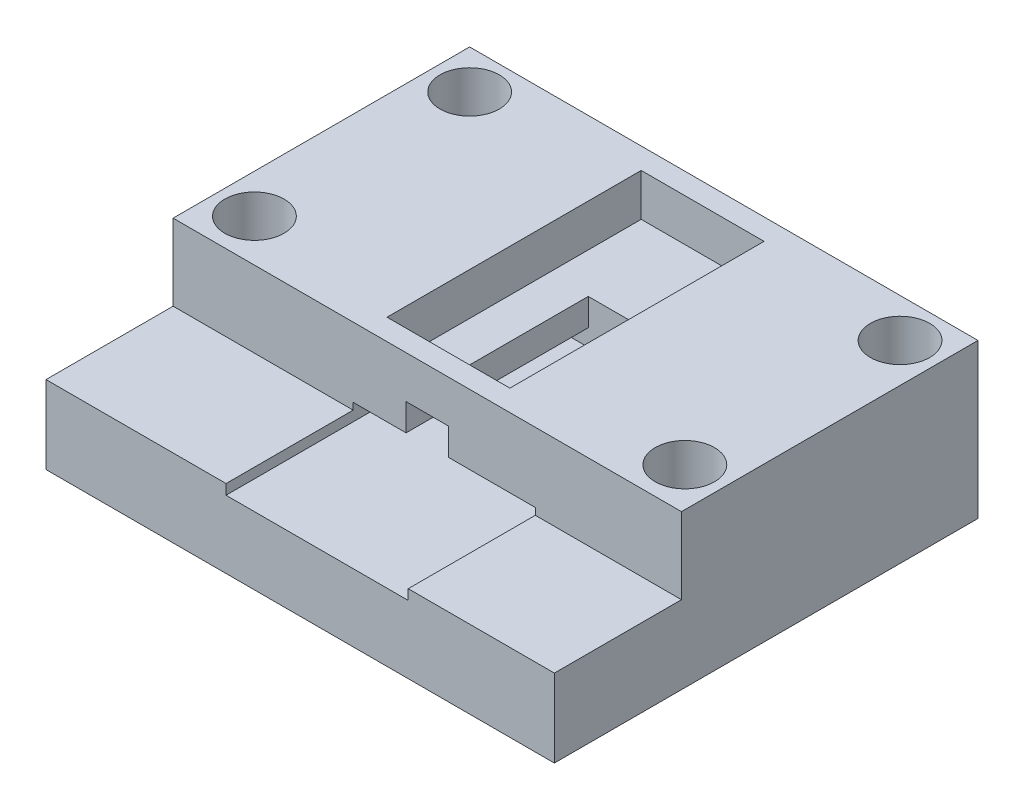
ISO-10303-21;
HEADER;
FILE_DESCRIPTION(('STEP AP214'),'2;1');
FILE_NAME('part.step','',(''),(''),'','','');
FILE_SCHEMA(('AUTOMOTIVE_DESIGN { 1 0 10303 214 1 1 1 1 }'));
ENDSEC;
DATA;
#1=APPLICATION_CONTEXT('core data for automotive mechanical design processes');
#2=APPLICATION_PROTOCOL_DEFINITION('international standard','automotive_design',2000,#1);
#3=PRODUCT_CONTEXT('',#1,'mechanical');
#4=PRODUCT('Part','Part','',(#3));
#5=PRODUCT_RELATED_PRODUCT_CATEGORY('part','',(#4));
#6=PRODUCT_DEFINITION_FORMATION('','',#4);
#7=PRODUCT_DEFINITION_CONTEXT('part definition',#1,'design');
#8=PRODUCT_DEFINITION('design','',#6,#7);
#9=PRODUCT_DEFINITION_SHAPE('','',#8);
#10=(LENGTH_UNIT() NAMED_UNIT(*) SI_UNIT(.MILLI.,.METRE.));
#11=(NAMED_UNIT(*) PLANE_ANGLE_UNIT() SI_UNIT($,.RADIAN.));
#12=(NAMED_UNIT(*) SI_UNIT($,.STERADIAN.) SOLID_ANGLE_UNIT());
#13=UNCERTAINTY_MEASURE_WITH_UNIT(LENGTH_MEASURE(1.E-05),#10,'distance_accuracy_value','');
#14=(GEOMETRIC_REPRESENTATION_CONTEXT(3) GLOBAL_UNCERTAINTY_ASSIGNED_CONTEXT((#13)) GLOBAL_UNIT_ASSIGNED_CONTEXT((#10,
#11,#12)) REPRESENTATION_CONTEXT('',''));
#15=CARTESIAN_POINT('',(0.,0.,0.));
#16=DIRECTION('',(0.,0.,1.));
#17=DIRECTION('',(1.,0.,0.));
#18=AXIS2_PLACEMENT_3D('',#15,#16,#17);
#19=CARTESIAN_POINT('',(0.,13.2,0.));
#20=DIRECTION('',(0.,1.,0.));
#21=DIRECTION('',(0.,0.,1.));
#22=AXIS2_PLACEMENT_3D('',#19,#20,#21);
#23=PLANE('',#22);
#24=DIRECTION('',(0.,0.,1.));
#25=VECTOR('',#24,1.);
#26=CARTESIAN_POINT('',(22.75,13.2,-47.5));
#27=LINE('',#26,#25);
#28=CARTESIAN_POINT('',(22.75,13.2,-47.5));
#29=VERTEX_POINT('',#28);
#30=CARTESIAN_POINT('',(22.75,13.2,-17.5));
#31=VERTEX_POINT('',#30);
#32=EDGE_CURVE('E285',#29,#31,#27,.T.);
#33=ORIENTED_EDGE('',*,*,#32,.T.);
#34=DIRECTION('',(1.,0.,0.));
#35=VECTOR('',#34,1.);
#36=CARTESIAN_POINT('',(22.75,13.2,-17.5));
#37=LINE('',#36,#35);
#38=CARTESIAN_POINT('',(27.5,13.2,-17.5));
#39=VERTEX_POINT('',#38);
#40=EDGE_CURVE('E304',#31,#39,#37,.T.);
#41=ORIENTED_EDGE('',*,*,#40,.T.);
#42=DIRECTION('',(0.,0.,1.));
#43=VECTOR('',#42,1.);
#44=CARTESIAN_POINT('',(27.5,13.2,0.));
#45=LINE('',#44,#43);
#46=CARTESIAN_POINT('',(27.5,13.2,-36.5));
#47=VERTEX_POINT('',#46);
#48=EDGE_CURVE('E339',#47,#39,#45,.T.);
#49=ORIENTED_EDGE('',*,*,#48,.F.);
#50=DIRECTION('',(1.,0.,0.));
#51=VECTOR('',#50,1.);
#52=CARTESIAN_POINT('',(0.,13.2,-36.5));
#53=LINE('',#52,#51);
#54=CARTESIAN_POINT('',(32.5,13.2,-36.5));
#55=VERTEX_POINT('',#54);
#56=EDGE_CURVE('E343',#47,#55,#53,.T.);
#57=ORIENTED_EDGE('',*,*,#56,.T.);
#58=DIRECTION('',(0.,0.,1.));
#59=VECTOR('',#58,1.);
#60=CARTESIAN_POINT('',(32.5,13.2,0.));
#61=LINE('',#60,#59);
#62=CARTESIAN_POINT('',(32.5,13.2,-17.5));
#63=VERTEX_POINT('',#62);
#64=EDGE_CURVE('E348',#55,#63,#61,.T.);
#65=ORIENTED_EDGE('',*,*,#64,.T.);
#66=CARTESIAN_POINT('',(37.25,13.2,-17.5));
#67=VERTEX_POINT('',#66);
#68=EDGE_CURVE('E309',#63,#67,#37,.T.);
#69=ORIENTED_EDGE('',*,*,#68,.T.);
#70=DIRECTION('',(0.,0.,-1.));
#71=VECTOR('',#70,1.);
#72=CARTESIAN_POINT('',(37.25,13.2,-47.5));
#73=LINE('',#72,#71);
#74=CARTESIAN_POINT('',(37.25,13.2,-47.5));
#75=VERTEX_POINT('',#74);
#76=EDGE_CURVE('E308',#67,#75,#73,.T.);
#77=ORIENTED_EDGE('',*,*,#76,.T.);
#78=DIRECTION('',(-1.,0.,0.));
#79=VECTOR('',#78,1.);
#80=CARTESIAN_POINT('',(22.75,13.2,-47.5));
#81=LINE('',#80,#79);
#82=EDGE_CURVE('E290',#75,#29,#81,.T.);
#83=ORIENTED_EDGE('',*,*,#82,.T.);
#84=EDGE_LOOP('',(#33,#41,#49,#57,#65,#69,#77,#83));
#85=FACE_BOUND('',#84,.T.);
#86=ADVANCED_FACE('F48',(#85),#23,.T.);
#87=CARTESIAN_POINT('',(0.,10.,0.));
#88=DIRECTION('',(1.,0.,0.));
#89=DIRECTION('',(0.,0.,-1.));
#90=AXIS2_PLACEMENT_3D('',#87,#88,#89);
#91=PLANE('',#90);
#92=DIRECTION('',(0.,0.,1.));
#93=VECTOR('',#92,1.);
#94=CARTESIAN_POINT('',(0.,9.2,-15.));
#95=LINE('',#94,#93);
#96=CARTESIAN_POINT('',(0.,9.2,-15.));
#97=VERTEX_POINT('',#96);
#98=CARTESIAN_POINT('',(0.,9.2,0.));
#99=VERTEX_POINT('',#98);
#100=EDGE_CURVE('E201',#97,#99,#95,.T.);
#101=ORIENTED_EDGE('',*,*,#100,.F.);
#102=DIRECTION('',(0.,1.,0.));
#103=VECTOR('',#102,1.);
#104=CARTESIAN_POINT('',(0.,9.2,-15.));
#105=LINE('',#104,#103);
#106=CARTESIAN_POINT('',(0.,18.2,-15.));
#107=VERTEX_POINT('',#106);
#108=EDGE_CURVE('E219',#97,#107,#105,.T.);
#109=ORIENTED_EDGE('',*,*,#108,.T.);
#110=DIRECTION('',(0.,0.,1.));
#111=VECTOR('',#110,1.);
#112=CARTESIAN_POINT('',(0.,18.2,-50.));
#113=LINE('',#112,#111);
#114=CARTESIAN_POINT('',(0.,18.2,-50.));
#115=VERTEX_POINT('',#114);
#116=EDGE_CURVE('E328',#115,#107,#113,.T.);
#117=ORIENTED_EDGE('',*,*,#116,.F.);
#118=DIRECTION('',(0.,-1.,0.));
#119=VECTOR('',#118,1.);
#120=CARTESIAN_POINT('',(0.,10.,-50.));
#121=LINE('',#120,#119);
#122=CARTESIAN_POINT('',(0.,0.,-50.));
#123=VERTEX_POINT('',#122);
#124=EDGE_CURVE('E424',#115,#123,#121,.T.);
#125=ORIENTED_EDGE('',*,*,#124,.T.);
#126=DIRECTION('',(0.,0.,1.));
#127=VECTOR('',#126,1.);
#128=CARTESIAN_POINT('',(0.,0.,0.));
#129=LINE('',#128,#127);
#130=CARTESIAN_POINT('',(0.,0.,0.));
#131=VERTEX_POINT('',#130);
#132=EDGE_CURVE('E399',#123,#131,#129,.T.);
#133=ORIENTED_EDGE('',*,*,#132,.T.);
#134=DIRECTION('',(0.,-1.,0.));
#135=VECTOR('',#134,1.);
#136=CARTESIAN_POINT('',(0.,10.,0.));
#137=LINE('',#136,#135);
#138=EDGE_CURVE('E435',#99,#131,#137,.T.);
#139=ORIENTED_EDGE('',*,*,#138,.F.);
#140=EDGE_LOOP('',(#101,#109,#117,#125,#133,#139));
#141=FACE_BOUND('',#140,.T.);
#142=ADVANCED_FACE('F50',(#141),#91,.F.);
#143=CARTESIAN_POINT('',(0.,10.,0.));
#144=DIRECTION('',(0.,0.,-1.));
#145=DIRECTION('',(-1.,0.,0.));
#146=AXIS2_PLACEMENT_3D('',#143,#144,#145);
#147=PLANE('',#146);
#148=DIRECTION('',(0.,-1.,0.));
#149=VECTOR('',#148,1.);
#150=CARTESIAN_POINT('',(60.,10.,0.));
#151=LINE('',#150,#149);
#152=CARTESIAN_POINT('',(60.,9.2,0.));
#153=VERTEX_POINT('',#152);
#154=CARTESIAN_POINT('',(60.,0.,0.));
#155=VERTEX_POINT('',#154);
#156=EDGE_CURVE('E432',#153,#155,#151,.T.);
#157=ORIENTED_EDGE('',*,*,#156,.F.);
#158=DIRECTION('',(1.,0.,0.));
#159=VECTOR('',#158,1.);
#160=CARTESIAN_POINT('',(60.,9.2,0.));
#161=LINE('',#160,#159);
#162=CARTESIAN_POINT('',(42.75,9.2,0.));
#163=VERTEX_POINT('',#162);
#164=EDGE_CURVE('E208',#163,#153,#161,.T.);
#165=ORIENTED_EDGE('',*,*,#164,.F.);
#166=DIRECTION('',(0.,1.,0.));
#167=VECTOR('',#166,1.);
#168=CARTESIAN_POINT('',(42.75,8.,0.));
#169=LINE('',#168,#167);
#170=CARTESIAN_POINT('',(42.75,8.,0.));
#171=VERTEX_POINT('',#170);
#172=EDGE_CURVE('E404',#171,#163,#169,.T.);
#173=ORIENTED_EDGE('',*,*,#172,.F.);
#174=DIRECTION('',(1.,0.,0.));
#175=VECTOR('',#174,1.);
#176=CARTESIAN_POINT('',(21.25,8.,0.));
#177=LINE('',#176,#175);
#178=CARTESIAN_POINT('',(21.25,8.,0.));
#179=VERTEX_POINT('',#178);
#180=EDGE_CURVE('E371',#179,#171,#177,.T.);
#181=ORIENTED_EDGE('',*,*,#180,.F.);
#182=DIRECTION('',(0.,1.,0.));
#183=VECTOR('',#182,1.);
#184=CARTESIAN_POINT('',(21.25,8.,0.));
#185=LINE('',#184,#183);
#186=CARTESIAN_POINT('',(21.25,9.2,0.));
#187=VERTEX_POINT('',#186);
#188=EDGE_CURVE('E384',#179,#187,#185,.T.);
#189=ORIENTED_EDGE('',*,*,#188,.T.);
#190=EDGE_CURVE('E220',#99,#187,#161,.T.);
#191=ORIENTED_EDGE('',*,*,#190,.F.);
#192=ORIENTED_EDGE('',*,*,#138,.T.);
#193=DIRECTION('',(1.,0.,0.));
#194=VECTOR('',#193,1.);
#195=CARTESIAN_POINT('',(0.,0.,0.));
#196=LINE('',#195,#194);
#197=EDGE_CURVE('E414',#131,#155,#196,.T.);
#198=ORIENTED_EDGE('',*,*,#197,.T.);
#199=EDGE_LOOP('',(#157,#165,#173,#181,#189,#191,#192,#198));
#200=FACE_BOUND('',#199,.T.);
#201=ADVANCED_FACE('F468',(#200),#147,.F.);
#202=CARTESIAN_POINT('',(60.,10.,0.));
#203=DIRECTION('',(-1.,0.,0.));
#204=DIRECTION('',(0.,0.,1.));
#205=AXIS2_PLACEMENT_3D('',#202,#203,#204);
#206=PLANE('',#205);
#207=DIRECTION('',(0.,0.,-1.));
#208=VECTOR('',#207,1.);
#209=CARTESIAN_POINT('',(60.,18.2,-50.));
#210=LINE('',#209,#208);
#211=CARTESIAN_POINT('',(60.,18.2,-15.));
#212=VERTEX_POINT('',#211);
#213=CARTESIAN_POINT('',(60.,18.2,-50.));
#214=VERTEX_POINT('',#213);
#215=EDGE_CURVE('E217',#212,#214,#210,.T.);
#216=ORIENTED_EDGE('',*,*,#215,.F.);
#217=DIRECTION('',(0.,1.,0.));
#218=VECTOR('',#217,1.);
#219=CARTESIAN_POINT('',(60.,9.2,-15.));
#220=LINE('',#219,#218);
#221=CARTESIAN_POINT('',(60.,9.2,-15.));
#222=VERTEX_POINT('',#221);
#223=EDGE_CURVE('E195',#222,#212,#220,.T.);
#224=ORIENTED_EDGE('',*,*,#223,.F.);
#225=DIRECTION('',(0.,0.,-1.));
#226=VECTOR('',#225,1.);
#227=CARTESIAN_POINT('',(60.,9.2,-15.));
#228=LINE('',#227,#226);
#229=EDGE_CURVE('E205',#153,#222,#228,.T.);
#230=ORIENTED_EDGE('',*,*,#229,.F.);
#231=ORIENTED_EDGE('',*,*,#156,.T.);
#232=DIRECTION('',(0.,0.,-1.));
#233=VECTOR('',#232,1.);
#234=CARTESIAN_POINT('',(60.,0.,0.));
#235=LINE('',#234,#233);
#236=CARTESIAN_POINT('',(60.,0.,-50.));
#237=VERTEX_POINT('',#236);
#238=EDGE_CURVE('E418',#155,#237,#235,.T.);
#239=ORIENTED_EDGE('',*,*,#238,.T.);
#240=DIRECTION('',(0.,-1.,0.));
#241=VECTOR('',#240,1.);
#242=CARTESIAN_POINT('',(60.,10.,-50.));
#243=LINE('',#242,#241);
#244=EDGE_CURVE('E428',#214,#237,#243,.T.);
#245=ORIENTED_EDGE('',*,*,#244,.F.);
#246=EDGE_LOOP('',(#216,#224,#230,#231,#239,#245));
#247=FACE_BOUND('',#246,.T.);
#248=ADVANCED_FACE('F215',(#247),#206,.F.);
#249=CARTESIAN_POINT('',(0.,10.,-50.));
#250=DIRECTION('',(0.,0.,1.));
#251=DIRECTION('',(1.,0.,0.));
#252=AXIS2_PLACEMENT_3D('',#249,#250,#251);
#253=PLANE('',#252);
#254=DIRECTION('',(-1.,0.,0.));
#255=VECTOR('',#254,1.);
#256=CARTESIAN_POINT('',(0.,0.,-50.));
#257=LINE('',#256,#255);
#258=EDGE_CURVE('E421',#237,#123,#257,.T.);
#259=ORIENTED_EDGE('',*,*,#258,.T.);
#260=ORIENTED_EDGE('',*,*,#124,.F.);
#261=DIRECTION('',(-1.,0.,0.));
#262=VECTOR('',#261,1.);
#263=CARTESIAN_POINT('',(0.,18.2,-50.));
#264=LINE('',#263,#262);
#265=EDGE_CURVE('E334',#214,#115,#264,.T.);
#266=ORIENTED_EDGE('',*,*,#265,.F.);
#267=ORIENTED_EDGE('',*,*,#244,.T.);
#268=EDGE_LOOP('',(#259,#260,#266,#267));
#269=FACE_BOUND('',#268,.T.);
#270=ADVANCED_FACE('F485',(#269),#253,.F.);
#271=CARTESIAN_POINT('',(0.,0.,0.));
#272=DIRECTION('',(0.,-1.,0.));
#273=DIRECTION('',(0.,0.,-1.));
#274=AXIS2_PLACEMENT_3D('',#271,#272,#273);
#275=PLANE('',#274);
#276=CARTESIAN_POINT('',(55.4,0.,-45.4));
#277=DIRECTION('',(0.,1.,0.));
#278=DIRECTION('',(0.,0.,1.));
#279=AXIS2_PLACEMENT_3D('',#276,#277,#278);
#280=CIRCLE('',#279,3.5);
#281=CARTESIAN_POINT('',(55.4,0.,-41.9));
#282=VERTEX_POINT('',#281);
#283=EDGE_CURVE('E266',#282,#282,#280,.T.);
#284=ORIENTED_EDGE('',*,*,#283,.T.);
#285=EDGE_LOOP('',(#284));
#286=FACE_BOUND('',#285,.T.);
#287=CARTESIAN_POINT('',(4.6,0.,-20.));
#288=DIRECTION('',(0.,1.,0.));
#289=DIRECTION('',(0.,0.,1.));
#290=AXIS2_PLACEMENT_3D('',#287,#288,#289);
#291=CIRCLE('',#290,3.50000000000001);
#292=CARTESIAN_POINT('',(4.6,0.,-16.5));
#293=VERTEX_POINT('',#292);
#294=EDGE_CURVE('E267',#293,#293,#291,.T.);
#295=ORIENTED_EDGE('',*,*,#294,.T.);
#296=EDGE_LOOP('',(#295));
#297=FACE_BOUND('',#296,.T.);
#298=CARTESIAN_POINT('',(55.4,0.,-20.));
#299=DIRECTION('',(0.,1.,0.));
#300=DIRECTION('',(0.,0.,1.));
#301=AXIS2_PLACEMENT_3D('',#298,#299,#300);
#302=CIRCLE('',#301,3.5);
#303=CARTESIAN_POINT('',(55.4,0.,-16.5));
#304=VERTEX_POINT('',#303);
#305=EDGE_CURVE('E257',#304,#304,#302,.T.);
#306=ORIENTED_EDGE('',*,*,#305,.T.);
#307=EDGE_LOOP('',(#306));
#308=FACE_BOUND('',#307,.T.);
#309=CARTESIAN_POINT('',(4.6,0.,-45.4));
#310=DIRECTION('',(0.,1.,0.));
#311=DIRECTION('',(0.,0.,1.));
#312=AXIS2_PLACEMENT_3D('',#309,#310,#311);
#313=CIRCLE('',#312,3.50000000000001);
#314=CARTESIAN_POINT('',(4.6,0.,-41.9));
#315=VERTEX_POINT('',#314);
#316=EDGE_CURVE('E281',#315,#315,#313,.T.);
#317=ORIENTED_EDGE('',*,*,#316,.T.);
#318=EDGE_LOOP('',(#317));
#319=FACE_BOUND('',#318,.T.);
#320=ORIENTED_EDGE('',*,*,#132,.F.);
#321=ORIENTED_EDGE('',*,*,#258,.F.);
#322=ORIENTED_EDGE('',*,*,#238,.F.);
#323=ORIENTED_EDGE('',*,*,#197,.F.);
#324=EDGE_LOOP('',(#320,#321,#322,#323));
#325=FACE_BOUND('',#324,.T.);
#326=ADVANCED_FACE('F490',(#286,#297,#308,#319,#325),#275,.T.);
#327=CARTESIAN_POINT('',(21.25,8.,-36.5));
#328=DIRECTION('',(-1.,0.,0.));
#329=DIRECTION('',(0.,0.,1.));
#330=AXIS2_PLACEMENT_3D('',#327,#328,#329);
#331=PLANE('',#330);
#332=DIRECTION('',(0.,0.,1.));
#333=VECTOR('',#332,1.);
#334=CARTESIAN_POINT('',(21.25,10.,-36.5));
#335=LINE('',#334,#333);
#336=CARTESIAN_POINT('',(21.25,10.,-36.5));
#337=VERTEX_POINT('',#336);
#338=CARTESIAN_POINT('',(21.25,10.,-15.));
#339=VERTEX_POINT('',#338);
#340=EDGE_CURVE('E366',#337,#339,#335,.T.);
#341=ORIENTED_EDGE('',*,*,#340,.T.);
#342=DIRECTION('',(0.,-1.,0.));
#343=VECTOR('',#342,1.);
#344=CARTESIAN_POINT('',(21.25,8.,-15.));
#345=LINE('',#344,#343);
#346=CARTESIAN_POINT('',(21.25,9.2,-15.));
#347=VERTEX_POINT('',#346);
#348=EDGE_CURVE('E239',#339,#347,#345,.T.);
#349=ORIENTED_EDGE('',*,*,#348,.T.);
#350=DIRECTION('',(0.,0.,1.));
#351=VECTOR('',#350,1.);
#352=CARTESIAN_POINT('',(21.25,9.2,-36.5));
#353=LINE('',#352,#351);
#354=EDGE_CURVE('E249',#347,#187,#353,.T.);
#355=ORIENTED_EDGE('',*,*,#354,.T.);
#356=ORIENTED_EDGE('',*,*,#188,.F.);
#357=DIRECTION('',(0.,0.,1.));
#358=VECTOR('',#357,1.);
#359=CARTESIAN_POINT('',(21.25,8.,-36.5));
#360=LINE('',#359,#358);
#361=CARTESIAN_POINT('',(21.25,8.,-36.5));
#362=VERTEX_POINT('',#361);
#363=EDGE_CURVE('E367',#362,#179,#360,.T.);
#364=ORIENTED_EDGE('',*,*,#363,.F.);
#365=DIRECTION('',(0.,1.,0.));
#366=VECTOR('',#365,1.);
#367=CARTESIAN_POINT('',(21.25,8.,-36.5));
#368=LINE('',#367,#366);
#369=EDGE_CURVE('E395',#362,#337,#368,.T.);
#370=ORIENTED_EDGE('',*,*,#369,.T.);
#371=EDGE_LOOP('',(#341,#349,#355,#356,#364,#370));
#372=FACE_BOUND('',#371,.T.);
#373=ADVANCED_FACE('F496',(#372),#331,.F.);
#374=CARTESIAN_POINT('',(21.25,8.,-36.5));
#375=DIRECTION('',(0.,0.,-1.));
#376=DIRECTION('',(-1.,0.,0.));
#377=AXIS2_PLACEMENT_3D('',#374,#375,#376);
#378=PLANE('',#377);
#379=DIRECTION('',(-1.,0.,0.));
#380=VECTOR('',#379,1.);
#381=CARTESIAN_POINT('',(21.25,10.,-36.5));
#382=LINE('',#381,#380);
#383=CARTESIAN_POINT('',(42.75,10.,-36.5));
#384=VERTEX_POINT('',#383);
#385=CARTESIAN_POINT('',(32.5,10.,-36.5));
#386=VERTEX_POINT('',#385);
#387=EDGE_CURVE('E372',#384,#386,#382,.T.);
#388=ORIENTED_EDGE('',*,*,#387,.T.);
#389=DIRECTION('',(0.,-1.,0.));
#390=VECTOR('',#389,1.);
#391=CARTESIAN_POINT('',(32.5,13.2,-36.5));
#392=LINE('',#391,#390);
#393=EDGE_CURVE('E352',#55,#386,#392,.T.);
#394=ORIENTED_EDGE('',*,*,#393,.F.);
#395=ORIENTED_EDGE('',*,*,#56,.F.);
#396=DIRECTION('',(0.,-1.,0.));
#397=VECTOR('',#396,1.);
#398=CARTESIAN_POINT('',(27.5,13.2,-36.5));
#399=LINE('',#398,#397);
#400=CARTESIAN_POINT('',(27.5,10.,-36.5));
#401=VERTEX_POINT('',#400);
#402=EDGE_CURVE('E362',#47,#401,#399,.T.);
#403=ORIENTED_EDGE('',*,*,#402,.T.);
#404=EDGE_CURVE('E391',#401,#337,#382,.T.);
#405=ORIENTED_EDGE('',*,*,#404,.T.);
#406=ORIENTED_EDGE('',*,*,#369,.F.);
#407=DIRECTION('',(-1.,0.,0.));
#408=VECTOR('',#407,1.);
#409=CARTESIAN_POINT('',(21.25,8.,-36.5));
#410=LINE('',#409,#408);
#411=CARTESIAN_POINT('',(42.75,8.,-36.5));
#412=VERTEX_POINT('',#411);
#413=EDGE_CURVE('E380',#412,#362,#410,.T.);
#414=ORIENTED_EDGE('',*,*,#413,.F.);
#415=DIRECTION('',(0.,1.,0.));
#416=VECTOR('',#415,1.);
#417=CARTESIAN_POINT('',(42.75,8.,-36.5));
#418=LINE('',#417,#416);
#419=EDGE_CURVE('E400',#412,#384,#418,.T.);
#420=ORIENTED_EDGE('',*,*,#419,.T.);
#421=EDGE_LOOP('',(#388,#394,#395,#403,#405,#406,#414,#420));
#422=FACE_BOUND('',#421,.T.);
#423=ADVANCED_FACE('F458',(#422),#378,.F.);
#424=CARTESIAN_POINT('',(42.75,8.,-36.5));
#425=DIRECTION('',(1.,0.,0.));
#426=DIRECTION('',(0.,0.,-1.));
#427=AXIS2_PLACEMENT_3D('',#424,#425,#426);
#428=PLANE('',#427);
#429=DIRECTION('',(0.,0.,-1.));
#430=VECTOR('',#429,1.);
#431=CARTESIAN_POINT('',(42.75,9.2,-36.5));
#432=LINE('',#431,#430);
#433=CARTESIAN_POINT('',(42.75,9.2,-15.));
#434=VERTEX_POINT('',#433);
#435=EDGE_CURVE('E12',#163,#434,#432,.T.);
#436=ORIENTED_EDGE('',*,*,#435,.T.);
#437=DIRECTION('',(0.,1.,0.));
#438=VECTOR('',#437,1.);
#439=CARTESIAN_POINT('',(42.75,8.,-15.));
#440=LINE('',#439,#438);
#441=CARTESIAN_POINT('',(42.75,10.,-15.));
#442=VERTEX_POINT('',#441);
#443=EDGE_CURVE('E198',#434,#442,#440,.T.);
#444=ORIENTED_EDGE('',*,*,#443,.T.);
#445=DIRECTION('',(0.,0.,-1.));
#446=VECTOR('',#445,1.);
#447=CARTESIAN_POINT('',(42.75,10.,-36.5));
#448=LINE('',#447,#446);
#449=EDGE_CURVE('E388',#442,#384,#448,.T.);
#450=ORIENTED_EDGE('',*,*,#449,.T.);
#451=ORIENTED_EDGE('',*,*,#419,.F.);
#452=DIRECTION('',(0.,0.,-1.));
#453=VECTOR('',#452,1.);
#454=CARTESIAN_POINT('',(42.75,8.,-36.5));
#455=LINE('',#454,#453);
#456=EDGE_CURVE('E376',#171,#412,#455,.T.);
#457=ORIENTED_EDGE('',*,*,#456,.F.);
#458=ORIENTED_EDGE('',*,*,#172,.T.);
#459=EDGE_LOOP('',(#436,#444,#450,#451,#457,#458));
#460=FACE_BOUND('',#459,.T.);
#461=ADVANCED_FACE('F465',(#460),#428,.F.);
#462=CARTESIAN_POINT('',(0.,8.,0.));
#463=DIRECTION('',(0.,1.,0.));
#464=DIRECTION('',(0.,0.,1.));
#465=AXIS2_PLACEMENT_3D('',#462,#463,#464);
#466=PLANE('',#465);
#467=ORIENTED_EDGE('',*,*,#363,.T.);
#468=ORIENTED_EDGE('',*,*,#180,.T.);
#469=ORIENTED_EDGE('',*,*,#456,.T.);
#470=ORIENTED_EDGE('',*,*,#413,.T.);
#471=EDGE_LOOP('',(#467,#468,#469,#470));
#472=FACE_BOUND('',#471,.T.);
#473=ADVANCED_FACE('F508',(#472),#466,.T.);
#474=CARTESIAN_POINT('',(0.,10.,0.));
#475=DIRECTION('',(0.,1.,0.));
#476=DIRECTION('',(0.,0.,1.));
#477=AXIS2_PLACEMENT_3D('',#474,#475,#476);
#478=PLANE('',#477);
#479=DIRECTION('',(0.,0.,1.));
#480=VECTOR('',#479,1.);
#481=CARTESIAN_POINT('',(27.5,10.,0.));
#482=LINE('',#481,#480);
#483=CARTESIAN_POINT('',(27.5,10.,-15.));
#484=VERTEX_POINT('',#483);
#485=EDGE_CURVE('E338',#401,#484,#482,.T.);
#486=ORIENTED_EDGE('',*,*,#485,.T.);
#487=DIRECTION('',(-1.,0.,0.));
#488=VECTOR('',#487,1.);
#489=CARTESIAN_POINT('',(0.,10.,-15.));
#490=LINE('',#489,#488);
#491=EDGE_CURVE('E235',#484,#339,#490,.T.);
#492=ORIENTED_EDGE('',*,*,#491,.T.);
#493=ORIENTED_EDGE('',*,*,#340,.F.);
#494=ORIENTED_EDGE('',*,*,#404,.F.);
#495=EDGE_LOOP('',(#486,#492,#493,#494));
#496=FACE_BOUND('',#495,.T.);
#497=ADVANCED_FACE('F499',(#496),#478,.F.);
#498=CARTESIAN_POINT('',(27.5,13.2,0.));
#499=DIRECTION('',(1.,0.,0.));
#500=DIRECTION('',(0.,0.,-1.));
#501=AXIS2_PLACEMENT_3D('',#498,#499,#500);
#502=PLANE('',#501);
#503=DIRECTION('',(0.,1.,0.));
#504=VECTOR('',#503,1.);
#505=CARTESIAN_POINT('',(27.5,13.2,-15.));
#506=LINE('',#505,#504);
#507=CARTESIAN_POINT('',(27.5,13.2,-15.));
#508=VERTEX_POINT('',#507);
#509=EDGE_CURVE('E64',#484,#508,#506,.T.);
#510=ORIENTED_EDGE('',*,*,#509,.F.);
#511=ORIENTED_EDGE('',*,*,#485,.F.);
#512=ORIENTED_EDGE('',*,*,#402,.F.);
#513=ORIENTED_EDGE('',*,*,#48,.T.);
#514=EDGE_CURVE('E344',#39,#508,#45,.T.);
#515=ORIENTED_EDGE('',*,*,#514,.T.);
#516=EDGE_LOOP('',(#510,#511,#512,#513,#515));
#517=FACE_BOUND('',#516,.T.);
#518=ADVANCED_FACE('F503',(#517),#502,.T.);
#519=CARTESIAN_POINT('',(32.5,13.2,0.));
#520=DIRECTION('',(1.,0.,0.));
#521=DIRECTION('',(0.,0.,-1.));
#522=AXIS2_PLACEMENT_3D('',#519,#520,#521);
#523=PLANE('',#522);
#524=DIRECTION('',(0.,0.,1.));
#525=VECTOR('',#524,1.);
#526=CARTESIAN_POINT('',(32.5,10.,0.));
#527=LINE('',#526,#525);
#528=CARTESIAN_POINT('',(32.5,10.,-15.));
#529=VERTEX_POINT('',#528);
#530=EDGE_CURVE('E356',#386,#529,#527,.T.);
#531=ORIENTED_EDGE('',*,*,#530,.T.);
#532=DIRECTION('',(0.,1.,0.));
#533=VECTOR('',#532,1.);
#534=CARTESIAN_POINT('',(32.5,13.2,-15.));
#535=LINE('',#534,#533);
#536=CARTESIAN_POINT('',(32.5,13.2,-15.));
#537=VERTEX_POINT('',#536);
#538=EDGE_CURVE('E225',#529,#537,#535,.T.);
#539=ORIENTED_EDGE('',*,*,#538,.T.);
#540=EDGE_CURVE('E347',#63,#537,#61,.T.);
#541=ORIENTED_EDGE('',*,*,#540,.F.);
#542=ORIENTED_EDGE('',*,*,#64,.F.);
#543=ORIENTED_EDGE('',*,*,#393,.T.);
#544=EDGE_LOOP('',(#531,#539,#541,#542,#543));
#545=FACE_BOUND('',#544,.T.);
#546=ADVANCED_FACE('F452',(#545),#523,.F.);
#547=ORIENTED_EDGE('',*,*,#449,.F.);
#548=DIRECTION('',(-1.,0.,0.));
#549=VECTOR('',#548,1.);
#550=CARTESIAN_POINT('',(0.,10.,-15.));
#551=LINE('',#550,#549);
#552=EDGE_CURVE('E243',#442,#529,#551,.T.);
#553=ORIENTED_EDGE('',*,*,#552,.T.);
#554=ORIENTED_EDGE('',*,*,#530,.F.);
#555=ORIENTED_EDGE('',*,*,#387,.F.);
#556=EDGE_LOOP('',(#547,#553,#554,#555));
#557=FACE_BOUND('',#556,.T.);
#558=ADVANCED_FACE('F463',(#557),#478,.F.);
#559=CARTESIAN_POINT('',(0.,18.2,0.));
#560=DIRECTION('',(0.,1.,0.));
#561=DIRECTION('',(0.,0.,1.));
#562=AXIS2_PLACEMENT_3D('',#559,#560,#561);
#563=PLANE('',#562);
#564=DIRECTION('',(-1.,0.,0.));
#565=VECTOR('',#564,1.);
#566=CARTESIAN_POINT('',(60.,18.2,-15.));
#567=LINE('',#566,#565);
#568=EDGE_CURVE('E212',#212,#107,#567,.T.);
#569=ORIENTED_EDGE('',*,*,#568,.F.);
#570=ORIENTED_EDGE('',*,*,#215,.T.);
#571=ORIENTED_EDGE('',*,*,#265,.T.);
#572=ORIENTED_EDGE('',*,*,#116,.T.);
#573=EDGE_LOOP('',(#569,#570,#571,#572));
#574=FACE_BOUND('',#573,.T.);
#575=CARTESIAN_POINT('',(55.4,18.2,-45.4));
#576=DIRECTION('',(0.,1.,0.));
#577=DIRECTION('',(0.,0.,1.));
#578=AXIS2_PLACEMENT_3D('',#575,#576,#577);
#579=CIRCLE('',#578,3.5);
#580=CARTESIAN_POINT('',(55.4,18.2,-41.9));
#581=VERTEX_POINT('',#580);
#582=EDGE_CURVE('E262',#581,#581,#579,.T.);
#583=ORIENTED_EDGE('',*,*,#582,.F.);
#584=EDGE_LOOP('',(#583));
#585=FACE_BOUND('',#584,.T.);
#586=CARTESIAN_POINT('',(4.6,18.2,-20.));
#587=DIRECTION('',(0.,1.,0.));
#588=DIRECTION('',(0.,0.,1.));
#589=AXIS2_PLACEMENT_3D('',#586,#587,#588);
#590=CIRCLE('',#589,3.50000000000001);
#591=CARTESIAN_POINT('',(4.6,18.2,-16.5));
#592=VERTEX_POINT('',#591);
#593=EDGE_CURVE('E261',#592,#592,#590,.T.);
#594=ORIENTED_EDGE('',*,*,#593,.F.);
#595=EDGE_LOOP('',(#594));
#596=FACE_BOUND('',#595,.T.);
#597=CARTESIAN_POINT('',(55.4,18.2,-20.));
#598=DIRECTION('',(0.,1.,0.));
#599=DIRECTION('',(0.,0.,1.));
#600=AXIS2_PLACEMENT_3D('',#597,#598,#599);
#601=CIRCLE('',#600,3.5);
#602=CARTESIAN_POINT('',(55.4,18.2,-16.5));
#603=VERTEX_POINT('',#602);
#604=EDGE_CURVE('E253',#603,#603,#601,.T.);
#605=ORIENTED_EDGE('',*,*,#604,.F.);
#606=EDGE_LOOP('',(#605));
#607=FACE_BOUND('',#606,.T.);
#608=CARTESIAN_POINT('',(4.6,18.2,-45.4));
#609=DIRECTION('',(0.,1.,0.));
#610=DIRECTION('',(0.,0.,1.));
#611=AXIS2_PLACEMENT_3D('',#608,#609,#610);
#612=CIRCLE('',#611,3.50000000000001);
#613=CARTESIAN_POINT('',(4.6,18.2,-41.9));
#614=VERTEX_POINT('',#613);
#615=EDGE_CURVE('E271',#614,#614,#612,.T.);
#616=ORIENTED_EDGE('',*,*,#615,.F.);
#617=EDGE_LOOP('',(#616));
#618=FACE_BOUND('',#617,.T.);
#619=DIRECTION('',(1.,0.,0.));
#620=VECTOR('',#619,1.);
#621=CARTESIAN_POINT('',(22.75,18.2,-17.5));
#622=LINE('',#621,#620);
#623=CARTESIAN_POINT('',(22.75,18.2,-17.5));
#624=VERTEX_POINT('',#623);
#625=CARTESIAN_POINT('',(37.25,18.2,-17.5));
#626=VERTEX_POINT('',#625);
#627=EDGE_CURVE('E289',#624,#626,#622,.T.);
#628=ORIENTED_EDGE('',*,*,#627,.F.);
#629=DIRECTION('',(0.,0.,1.));
#630=VECTOR('',#629,1.);
#631=CARTESIAN_POINT('',(22.75,18.2,-47.5));
#632=LINE('',#631,#630);
#633=CARTESIAN_POINT('',(22.75,18.2,-47.5));
#634=VERTEX_POINT('',#633);
#635=EDGE_CURVE('E286',#634,#624,#632,.T.);
#636=ORIENTED_EDGE('',*,*,#635,.F.);
#637=DIRECTION('',(-1.,0.,0.));
#638=VECTOR('',#637,1.);
#639=CARTESIAN_POINT('',(22.75,18.2,-47.5));
#640=LINE('',#639,#638);
#641=CARTESIAN_POINT('',(37.25,18.2,-47.5));
#642=VERTEX_POINT('',#641);
#643=EDGE_CURVE('E297',#642,#634,#640,.T.);
#644=ORIENTED_EDGE('',*,*,#643,.F.);
#645=DIRECTION('',(0.,0.,-1.));
#646=VECTOR('',#645,1.);
#647=CARTESIAN_POINT('',(37.25,18.2,-47.5));
#648=LINE('',#647,#646);
#649=EDGE_CURVE('E293',#626,#642,#648,.T.);
#650=ORIENTED_EDGE('',*,*,#649,.F.);
#651=EDGE_LOOP('',(#628,#636,#644,#650));
#652=FACE_BOUND('',#651,.T.);
#653=ADVANCED_FACE('F481',(#574,#585,#596,#607,#618,#652),#563,.T.);
#654=CARTESIAN_POINT('',(0.,13.2,0.));
#655=DIRECTION('',(0.,1.,0.));
#656=DIRECTION('',(0.,0.,1.));
#657=AXIS2_PLACEMENT_3D('',#654,#655,#656);
#658=PLANE('',#657);
#659=ORIENTED_EDGE('',*,*,#540,.T.);
#660=DIRECTION('',(-1.,0.,0.));
#661=VECTOR('',#660,1.);
#662=CARTESIAN_POINT('',(0.,13.2,-15.));
#663=LINE('',#662,#661);
#664=EDGE_CURVE('E57',#537,#508,#663,.T.);
#665=ORIENTED_EDGE('',*,*,#664,.T.);
#666=ORIENTED_EDGE('',*,*,#514,.F.);
#667=EDGE_CURVE('E303',#39,#63,#37,.T.);
#668=ORIENTED_EDGE('',*,*,#667,.T.);
#669=EDGE_LOOP('',(#659,#665,#666,#668));
#670=FACE_BOUND('',#669,.T.);
#671=ADVANCED_FACE('F448',(#670),#658,.F.);
#672=CARTESIAN_POINT('',(22.75,18.2,-47.5));
#673=DIRECTION('',(1.,0.,0.));
#674=DIRECTION('',(0.,0.,-1.));
#675=AXIS2_PLACEMENT_3D('',#672,#673,#674);
#676=PLANE('',#675);
#677=ORIENTED_EDGE('',*,*,#32,.F.);
#678=DIRECTION('',(0.,-1.,0.));
#679=VECTOR('',#678,1.);
#680=CARTESIAN_POINT('',(22.75,18.2,-47.5));
#681=LINE('',#680,#679);
#682=EDGE_CURVE('E72',#634,#29,#681,.T.);
#683=ORIENTED_EDGE('',*,*,#682,.F.);
#684=ORIENTED_EDGE('',*,*,#635,.T.);
#685=DIRECTION('',(0.,-1.,0.));
#686=VECTOR('',#685,1.);
#687=CARTESIAN_POINT('',(22.75,18.2,-17.5));
#688=LINE('',#687,#686);
#689=EDGE_CURVE('E324',#624,#31,#688,.T.);
#690=ORIENTED_EDGE('',*,*,#689,.T.);
#691=EDGE_LOOP('',(#677,#683,#684,#690));
#692=FACE_BOUND('',#691,.T.);
#693=ADVANCED_FACE('F555',(#692),#676,.T.);
#694=CARTESIAN_POINT('',(22.75,18.2,-17.5));
#695=DIRECTION('',(0.,0.,-1.));
#696=DIRECTION('',(-1.,0.,0.));
#697=AXIS2_PLACEMENT_3D('',#694,#695,#696);
#698=PLANE('',#697);
#699=ORIENTED_EDGE('',*,*,#40,.F.);
#700=ORIENTED_EDGE('',*,*,#689,.F.);
#701=ORIENTED_EDGE('',*,*,#627,.T.);
#702=DIRECTION('',(0.,-1.,0.));
#703=VECTOR('',#702,1.);
#704=CARTESIAN_POINT('',(37.25,18.2,-17.5));
#705=LINE('',#704,#703);
#706=EDGE_CURVE('E321',#626,#67,#705,.T.);
#707=ORIENTED_EDGE('',*,*,#706,.T.);
#708=ORIENTED_EDGE('',*,*,#68,.F.);
#709=ORIENTED_EDGE('',*,*,#667,.F.);
#710=EDGE_LOOP('',(#699,#700,#701,#707,#708,#709));
#711=FACE_BOUND('',#710,.T.);
#712=ADVANCED_FACE('F642',(#711),#698,.T.);
#713=CARTESIAN_POINT('',(37.25,18.2,-47.5));
#714=DIRECTION('',(-1.,0.,0.));
#715=DIRECTION('',(0.,0.,1.));
#716=AXIS2_PLACEMENT_3D('',#713,#714,#715);
#717=PLANE('',#716);
#718=ORIENTED_EDGE('',*,*,#76,.F.);
#719=ORIENTED_EDGE('',*,*,#706,.F.);
#720=ORIENTED_EDGE('',*,*,#649,.T.);
#721=DIRECTION('',(0.,-1.,0.));
#722=VECTOR('',#721,1.);
#723=CARTESIAN_POINT('',(37.25,18.2,-47.5));
#724=LINE('',#723,#722);
#725=EDGE_CURVE('E318',#642,#75,#724,.T.);
#726=ORIENTED_EDGE('',*,*,#725,.T.);
#727=EDGE_LOOP('',(#718,#719,#720,#726));
#728=FACE_BOUND('',#727,.T.);
#729=ADVANCED_FACE('F633',(#728),#717,.T.);
#730=CARTESIAN_POINT('',(22.75,18.2,-47.5));
#731=DIRECTION('',(0.,0.,1.));
#732=DIRECTION('',(1.,0.,0.));
#733=AXIS2_PLACEMENT_3D('',#730,#731,#732);
#734=PLANE('',#733);
#735=ORIENTED_EDGE('',*,*,#82,.F.);
#736=ORIENTED_EDGE('',*,*,#725,.F.);
#737=ORIENTED_EDGE('',*,*,#643,.T.);
#738=ORIENTED_EDGE('',*,*,#682,.T.);
#739=EDGE_LOOP('',(#735,#736,#737,#738));
#740=FACE_BOUND('',#739,.T.);
#741=ADVANCED_FACE('F623',(#740),#734,.T.);
#742=CARTESIAN_POINT('',(4.6,0.,-45.4));
#743=DIRECTION('',(0.,1.,0.));
#744=DIRECTION('',(0.,0.,1.));
#745=AXIS2_PLACEMENT_3D('',#742,#743,#744);
#746=CYLINDRICAL_SURFACE('',#745,3.50000000000001);
#747=ORIENTED_EDGE('',*,*,#316,.F.);
#748=EDGE_LOOP('',(#747));
#749=FACE_BOUND('',#748,.T.);
#750=ORIENTED_EDGE('',*,*,#615,.T.);
#751=EDGE_LOOP('',(#750));
#752=FACE_BOUND('',#751,.T.);
#753=ADVANCED_FACE('F613',(#749,#752),#746,.F.);
#754=CARTESIAN_POINT('',(55.4,0.,-20.));
#755=DIRECTION('',(0.,1.,0.));
#756=DIRECTION('',(0.,0.,1.));
#757=AXIS2_PLACEMENT_3D('',#754,#755,#756);
#758=CYLINDRICAL_SURFACE('',#757,3.5);
#759=ORIENTED_EDGE('',*,*,#305,.F.);
#760=EDGE_LOOP('',(#759));
#761=FACE_BOUND('',#760,.T.);
#762=ORIENTED_EDGE('',*,*,#604,.T.);
#763=EDGE_LOOP('',(#762));
#764=FACE_BOUND('',#763,.T.);
#765=ADVANCED_FACE('F603',(#761,#764),#758,.F.);
#766=CARTESIAN_POINT('',(4.6,0.,-20.));
#767=DIRECTION('',(0.,1.,0.));
#768=DIRECTION('',(0.,0.,1.));
#769=AXIS2_PLACEMENT_3D('',#766,#767,#768);
#770=CYLINDRICAL_SURFACE('',#769,3.50000000000001);
#771=ORIENTED_EDGE('',*,*,#294,.F.);
#772=EDGE_LOOP('',(#771));
#773=FACE_BOUND('',#772,.T.);
#774=ORIENTED_EDGE('',*,*,#593,.T.);
#775=EDGE_LOOP('',(#774));
#776=FACE_BOUND('',#775,.T.);
#777=ADVANCED_FACE('F593',(#773,#776),#770,.F.);
#778=CARTESIAN_POINT('',(55.4,0.,-45.4));
#779=DIRECTION('',(0.,1.,0.));
#780=DIRECTION('',(0.,0.,1.));
#781=AXIS2_PLACEMENT_3D('',#778,#779,#780);
#782=CYLINDRICAL_SURFACE('',#781,3.5);
#783=ORIENTED_EDGE('',*,*,#283,.F.);
#784=EDGE_LOOP('',(#783));
#785=FACE_BOUND('',#784,.T.);
#786=ORIENTED_EDGE('',*,*,#582,.T.);
#787=EDGE_LOOP('',(#786));
#788=FACE_BOUND('',#787,.T.);
#789=ADVANCED_FACE('F563',(#785,#788),#782,.F.);
#790=CARTESIAN_POINT('',(0.,9.2,0.));
#791=DIRECTION('',(0.,-1.,0.));
#792=DIRECTION('',(0.,0.,-1.));
#793=AXIS2_PLACEMENT_3D('',#790,#791,#792);
#794=PLANE('',#793);
#795=DIRECTION('',(-1.,0.,0.));
#796=VECTOR('',#795,1.);
#797=CARTESIAN_POINT('',(60.,9.2,-15.));
#798=LINE('',#797,#796);
#799=EDGE_CURVE('E202',#347,#97,#798,.T.);
#800=ORIENTED_EDGE('',*,*,#799,.T.);
#801=ORIENTED_EDGE('',*,*,#100,.T.);
#802=ORIENTED_EDGE('',*,*,#190,.T.);
#803=ORIENTED_EDGE('',*,*,#354,.F.);
#804=EDGE_LOOP('',(#800,#801,#802,#803));
#805=FACE_BOUND('',#804,.T.);
#806=ADVANCED_FACE('F494',(#805),#794,.F.);
#807=ORIENTED_EDGE('',*,*,#164,.T.);
#808=ORIENTED_EDGE('',*,*,#229,.T.);
#809=EDGE_CURVE('E191',#222,#434,#798,.T.);
#810=ORIENTED_EDGE('',*,*,#809,.T.);
#811=ORIENTED_EDGE('',*,*,#435,.F.);
#812=EDGE_LOOP('',(#807,#808,#810,#811));
#813=FACE_BOUND('',#812,.T.);
#814=ADVANCED_FACE('F206',(#813),#794,.F.);
#815=CARTESIAN_POINT('',(60.,9.2,-15.));
#816=DIRECTION('',(0.,0.,-1.));
#817=DIRECTION('',(-1.,0.,0.));
#818=AXIS2_PLACEMENT_3D('',#815,#816,#817);
#819=PLANE('',#818);
#820=ORIENTED_EDGE('',*,*,#809,.F.);
#821=ORIENTED_EDGE('',*,*,#223,.T.);
#822=ORIENTED_EDGE('',*,*,#568,.T.);
#823=ORIENTED_EDGE('',*,*,#108,.F.);
#824=ORIENTED_EDGE('',*,*,#799,.F.);
#825=ORIENTED_EDGE('',*,*,#348,.F.);
#826=ORIENTED_EDGE('',*,*,#491,.F.);
#827=ORIENTED_EDGE('',*,*,#509,.T.);
#828=ORIENTED_EDGE('',*,*,#664,.F.);
#829=ORIENTED_EDGE('',*,*,#538,.F.);
#830=ORIENTED_EDGE('',*,*,#552,.F.);
#831=ORIENTED_EDGE('',*,*,#443,.F.);
#832=EDGE_LOOP('',(#820,#821,#822,#823,#824,#825,#826,#827,#828,#829,#830,#831));
#833=FACE_BOUND('',#832,.T.);
#834=ADVANCED_FACE('F193',(#833),#819,.F.);
#835=CLOSED_SHELL('',(#86,#142,#201,#248,#270,#326,#373,#423,#461,#473,#497,#518,#546,#558,#653,
#671,#693,#712,#729,#741,#753,#765,#777,#789,#806,#814,#834));
#836=MANIFOLD_SOLID_BREP('B2',#835);
#837=ADVANCED_BREP_SHAPE_REPRESENTATION('',(#18,#836),#14);
#838=SHAPE_DEFINITION_REPRESENTATION(#9,#837);
ENDSEC;
END-ISO-10303-21;
